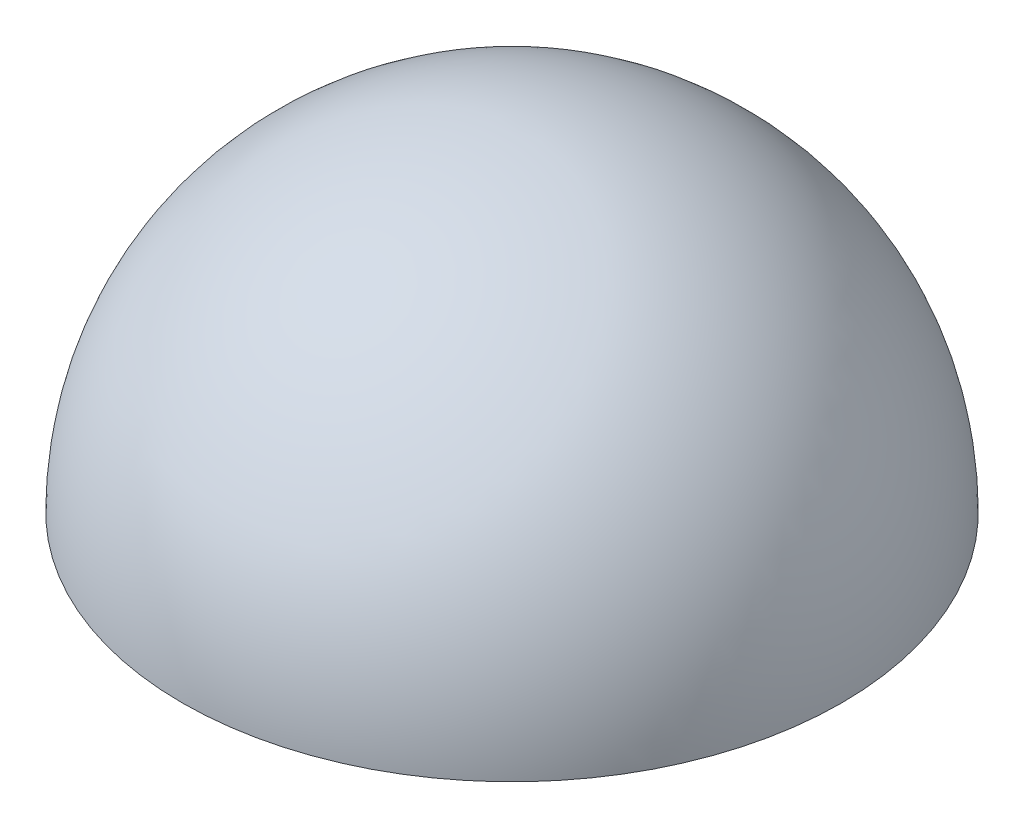
ISO-10303-21;
HEADER;
FILE_DESCRIPTION(('STEP AP214'),'2;1');
FILE_NAME('part.step','',(''),(''),'','','');
FILE_SCHEMA(('AUTOMOTIVE_DESIGN { 1 0 10303 214 1 1 1 1 }'));
ENDSEC;
DATA;
#1=APPLICATION_CONTEXT('core data for automotive mechanical design processes');
#2=APPLICATION_PROTOCOL_DEFINITION('international standard','automotive_design',2000,#1);
#3=PRODUCT_CONTEXT('',#1,'mechanical');
#4=PRODUCT('Part','Part','',(#3));
#5=PRODUCT_RELATED_PRODUCT_CATEGORY('part','',(#4));
#6=PRODUCT_DEFINITION_FORMATION('','',#4);
#7=PRODUCT_DEFINITION_CONTEXT('part definition',#1,'design');
#8=PRODUCT_DEFINITION('design','',#6,#7);
#9=PRODUCT_DEFINITION_SHAPE('','',#8);
#10=(LENGTH_UNIT() NAMED_UNIT(*) SI_UNIT(.MILLI.,.METRE.));
#11=(NAMED_UNIT(*) PLANE_ANGLE_UNIT() SI_UNIT($,.RADIAN.));
#12=(NAMED_UNIT(*) SI_UNIT($,.STERADIAN.) SOLID_ANGLE_UNIT());
#13=UNCERTAINTY_MEASURE_WITH_UNIT(LENGTH_MEASURE(1.E-05),#10,'distance_accuracy_value','');
#14=(GEOMETRIC_REPRESENTATION_CONTEXT(3) GLOBAL_UNCERTAINTY_ASSIGNED_CONTEXT((#13)) GLOBAL_UNIT_ASSIGNED_CONTEXT((#10,
#11,#12)) REPRESENTATION_CONTEXT('',''));
#15=CARTESIAN_POINT('',(0.,0.,0.));
#16=DIRECTION('',(0.,0.,1.));
#17=DIRECTION('',(1.,0.,0.));
#18=AXIS2_PLACEMENT_3D('',#15,#16,#17);
#19=CARTESIAN_POINT('',(0.,2.,0.));
#20=DIRECTION('',(0.,-1.,0.));
#21=DIRECTION('',(1.,0.,0.));
#22=AXIS2_PLACEMENT_3D('',#19,#20,#21);
#23=SPHERICAL_SURFACE('',#22,3.);
#24=CARTESIAN_POINT('',(0.,2.,0.));
#25=DIRECTION('',(0.,-1.,0.));
#26=DIRECTION('',(0.,0.,-1.));
#27=AXIS2_PLACEMENT_3D('',#24,#25,#26);
#28=CIRCLE('',#27,3.);
#29=CARTESIAN_POINT('',(0.,2.,-3.));
#30=VERTEX_POINT('',#29);
#31=EDGE_CURVE('E10',#30,#30,#28,.T.);
#32=ORIENTED_EDGE('',*,*,#31,.F.);
#33=EDGE_LOOP('',(#32));
#34=FACE_BOUND('',#33,.T.);
#35=ADVANCED_FACE('F32',(#34),#23,.T.);
#36=CARTESIAN_POINT('',(0.,2.,0.));
#37=DIRECTION('',(0.,-1.,0.));
#38=DIRECTION('',(0.,0.,-1.));
#39=AXIS2_PLACEMENT_3D('',#36,#37,#38);
#40=PLANE('',#39);
#41=ORIENTED_EDGE('',*,*,#31,.T.);
#42=EDGE_LOOP('',(#41));
#43=FACE_BOUND('',#42,.T.);
#44=ADVANCED_FACE('F39',(#43),#40,.T.);
#45=CLOSED_SHELL('',(#35,#44));
#46=MANIFOLD_SOLID_BREP('B2',#45);
#47=ADVANCED_BREP_SHAPE_REPRESENTATION('',(#18,#46),#14);
#48=SHAPE_DEFINITION_REPRESENTATION(#9,#47);
ENDSEC;
END-ISO-10303-21;
